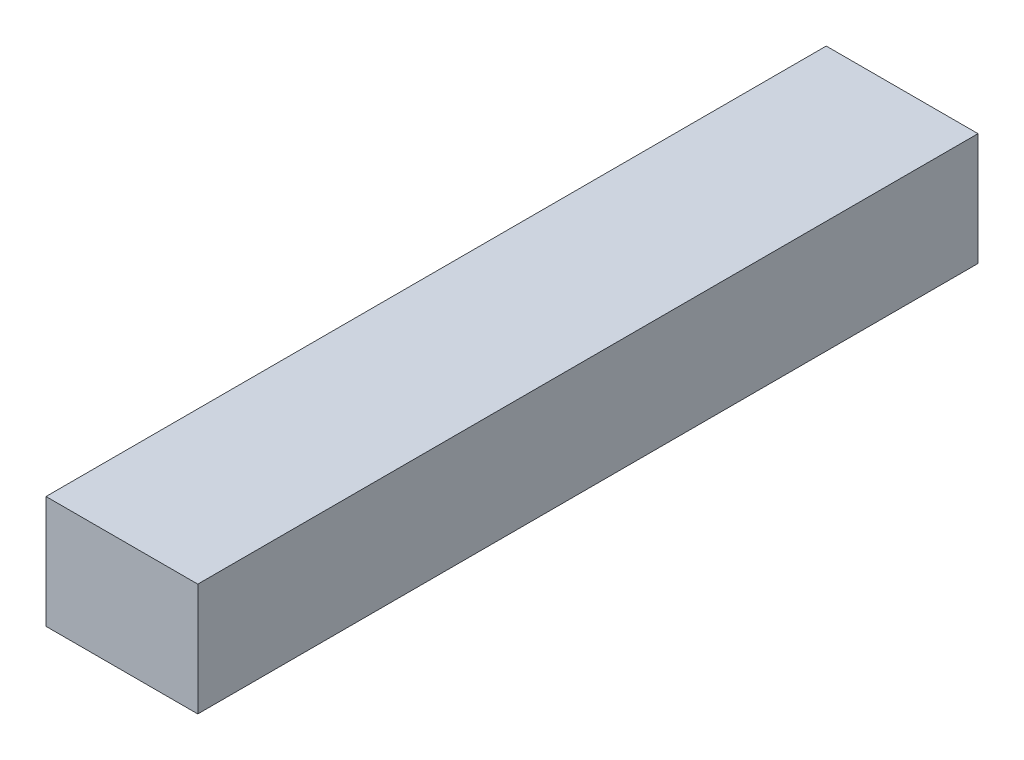
ISO-10303-21;
HEADER;
FILE_DESCRIPTION(('STEP AP214'),'2;1');
FILE_NAME('part.step','',(''),(''),'','','');
FILE_SCHEMA(('AUTOMOTIVE_DESIGN { 1 0 10303 214 1 1 1 1 }'));
ENDSEC;
DATA;
#1=APPLICATION_CONTEXT('core data for automotive mechanical design processes');
#2=APPLICATION_PROTOCOL_DEFINITION('international standard','automotive_design',2000,#1);
#3=PRODUCT_CONTEXT('',#1,'mechanical');
#4=PRODUCT('Part','Part','',(#3));
#5=PRODUCT_RELATED_PRODUCT_CATEGORY('part','',(#4));
#6=PRODUCT_DEFINITION_FORMATION('','',#4);
#7=PRODUCT_DEFINITION_CONTEXT('part definition',#1,'design');
#8=PRODUCT_DEFINITION('design','',#6,#7);
#9=PRODUCT_DEFINITION_SHAPE('','',#8);
#10=(LENGTH_UNIT() NAMED_UNIT(*) SI_UNIT(.MILLI.,.METRE.));
#11=(NAMED_UNIT(*) PLANE_ANGLE_UNIT() SI_UNIT($,.RADIAN.));
#12=(NAMED_UNIT(*) SI_UNIT($,.STERADIAN.) SOLID_ANGLE_UNIT());
#13=UNCERTAINTY_MEASURE_WITH_UNIT(LENGTH_MEASURE(1.E-05),#10,'distance_accuracy_value','');
#14=(GEOMETRIC_REPRESENTATION_CONTEXT(3) GLOBAL_UNCERTAINTY_ASSIGNED_CONTEXT((#13)) GLOBAL_UNIT_ASSIGNED_CONTEXT((#10,
#11,#12)) REPRESENTATION_CONTEXT('',''));
#15=CARTESIAN_POINT('',(0.,0.,0.));
#16=DIRECTION('',(0.,0.,1.));
#17=DIRECTION('',(1.,0.,0.));
#18=AXIS2_PLACEMENT_3D('',#15,#16,#17);
#19=CARTESIAN_POINT('',(3.9,-2.89,40.1));
#20=DIRECTION('',(-1.,0.,0.));
#21=DIRECTION('',(0.,0.,1.));
#22=AXIS2_PLACEMENT_3D('',#19,#20,#21);
#23=PLANE('',#22);
#24=DIRECTION('',(0.,1.,0.));
#25=VECTOR('',#24,1.);
#26=CARTESIAN_POINT('',(3.9,-2.89,0.));
#27=LINE('',#26,#25);
#28=CARTESIAN_POINT('',(3.9,-2.89,0.));
#29=VERTEX_POINT('',#28);
#30=CARTESIAN_POINT('',(3.9,2.89,0.));
#31=VERTEX_POINT('',#30);
#32=EDGE_CURVE('E96',#29,#31,#27,.T.);
#33=ORIENTED_EDGE('',*,*,#32,.T.);
#34=DIRECTION('',(0.,0.,-1.));
#35=VECTOR('',#34,1.);
#36=CARTESIAN_POINT('',(3.9,2.89,40.1));
#37=LINE('',#36,#35);
#38=CARTESIAN_POINT('',(3.9,2.89,40.1));
#39=VERTEX_POINT('',#38);
#40=EDGE_CURVE('E11',#39,#31,#37,.T.);
#41=ORIENTED_EDGE('',*,*,#40,.F.);
#42=DIRECTION('',(0.,1.,0.));
#43=VECTOR('',#42,1.);
#44=CARTESIAN_POINT('',(3.9,-2.89,40.1));
#45=LINE('',#44,#43);
#46=CARTESIAN_POINT('',(3.9,-2.89,40.1));
#47=VERTEX_POINT('',#46);
#48=EDGE_CURVE('E84',#47,#39,#45,.T.);
#49=ORIENTED_EDGE('',*,*,#48,.F.);
#50=DIRECTION('',(0.,0.,-1.));
#51=VECTOR('',#50,1.);
#52=CARTESIAN_POINT('',(3.9,-2.89,40.1));
#53=LINE('',#52,#51);
#54=EDGE_CURVE('E92',#47,#29,#53,.T.);
#55=ORIENTED_EDGE('',*,*,#54,.T.);
#56=EDGE_LOOP('',(#33,#41,#49,#55));
#57=FACE_BOUND('',#56,.T.);
#58=ADVANCED_FACE('F33',(#57),#23,.F.);
#59=CARTESIAN_POINT('',(-3.9,2.89,40.1));
#60=DIRECTION('',(0.,-1.,0.));
#61=DIRECTION('',(0.,0.,-1.));
#62=AXIS2_PLACEMENT_3D('',#59,#60,#61);
#63=PLANE('',#62);
#64=DIRECTION('',(-1.,0.,0.));
#65=VECTOR('',#64,1.);
#66=CARTESIAN_POINT('',(-3.9,2.89,0.));
#67=LINE('',#66,#65);
#68=CARTESIAN_POINT('',(-3.9,2.89,0.));
#69=VERTEX_POINT('',#68);
#70=EDGE_CURVE('E88',#31,#69,#67,.T.);
#71=ORIENTED_EDGE('',*,*,#70,.T.);
#72=DIRECTION('',(0.,0.,-1.));
#73=VECTOR('',#72,1.);
#74=CARTESIAN_POINT('',(-3.9,2.89,40.1));
#75=LINE('',#74,#73);
#76=CARTESIAN_POINT('',(-3.9,2.89,40.1));
#77=VERTEX_POINT('',#76);
#78=EDGE_CURVE('E41',#77,#69,#75,.T.);
#79=ORIENTED_EDGE('',*,*,#78,.F.);
#80=DIRECTION('',(-1.,0.,0.));
#81=VECTOR('',#80,1.);
#82=CARTESIAN_POINT('',(-3.9,2.89,40.1));
#83=LINE('',#82,#81);
#84=EDGE_CURVE('E79',#39,#77,#83,.T.);
#85=ORIENTED_EDGE('',*,*,#84,.F.);
#86=ORIENTED_EDGE('',*,*,#40,.T.);
#87=EDGE_LOOP('',(#71,#79,#85,#86));
#88=FACE_BOUND('',#87,.T.);
#89=ADVANCED_FACE('F87',(#88),#63,.F.);
#90=CARTESIAN_POINT('',(-3.9,-2.89,40.1));
#91=DIRECTION('',(1.,0.,0.));
#92=DIRECTION('',(0.,0.,-1.));
#93=AXIS2_PLACEMENT_3D('',#90,#91,#92);
#94=PLANE('',#93);
#95=DIRECTION('',(0.,-1.,0.));
#96=VECTOR('',#95,1.);
#97=CARTESIAN_POINT('',(-3.9,-2.89,0.));
#98=LINE('',#97,#96);
#99=CARTESIAN_POINT('',(-3.9,-2.89,0.));
#100=VERTEX_POINT('',#99);
#101=EDGE_CURVE('E66',#69,#100,#98,.T.);
#102=ORIENTED_EDGE('',*,*,#101,.T.);
#103=DIRECTION('',(0.,0.,-1.));
#104=VECTOR('',#103,1.);
#105=CARTESIAN_POINT('',(-3.9,-2.89,40.1));
#106=LINE('',#105,#104);
#107=CARTESIAN_POINT('',(-3.9,-2.89,40.1));
#108=VERTEX_POINT('',#107);
#109=EDGE_CURVE('E89',#108,#100,#106,.T.);
#110=ORIENTED_EDGE('',*,*,#109,.F.);
#111=DIRECTION('',(0.,-1.,0.));
#112=VECTOR('',#111,1.);
#113=CARTESIAN_POINT('',(-3.9,-2.89,40.1));
#114=LINE('',#113,#112);
#115=EDGE_CURVE('E82',#77,#108,#114,.T.);
#116=ORIENTED_EDGE('',*,*,#115,.F.);
#117=ORIENTED_EDGE('',*,*,#78,.T.);
#118=EDGE_LOOP('',(#102,#110,#116,#117));
#119=FACE_BOUND('',#118,.T.);
#120=ADVANCED_FACE('F90',(#119),#94,.F.);
#121=CARTESIAN_POINT('',(-3.9,-2.89,40.1));
#122=DIRECTION('',(0.,1.,0.));
#123=DIRECTION('',(0.,0.,1.));
#124=AXIS2_PLACEMENT_3D('',#121,#122,#123);
#125=PLANE('',#124);
#126=DIRECTION('',(1.,0.,0.));
#127=VECTOR('',#126,1.);
#128=CARTESIAN_POINT('',(-3.9,-2.89,0.));
#129=LINE('',#128,#127);
#130=EDGE_CURVE('E72',#100,#29,#129,.T.);
#131=ORIENTED_EDGE('',*,*,#130,.T.);
#132=ORIENTED_EDGE('',*,*,#54,.F.);
#133=DIRECTION('',(1.,0.,0.));
#134=VECTOR('',#133,1.);
#135=CARTESIAN_POINT('',(-3.9,-2.89,40.1));
#136=LINE('',#135,#134);
#137=EDGE_CURVE('E49',#108,#47,#136,.T.);
#138=ORIENTED_EDGE('',*,*,#137,.F.);
#139=ORIENTED_EDGE('',*,*,#109,.T.);
#140=EDGE_LOOP('',(#131,#132,#138,#139));
#141=FACE_BOUND('',#140,.T.);
#142=ADVANCED_FACE('F103',(#141),#125,.F.);
#143=CARTESIAN_POINT('',(0.,0.,40.1));
#144=DIRECTION('',(0.,0.,-1.));
#145=DIRECTION('',(-1.,0.,0.));
#146=AXIS2_PLACEMENT_3D('',#143,#144,#145);
#147=PLANE('',#146);
#148=ORIENTED_EDGE('',*,*,#48,.T.);
#149=ORIENTED_EDGE('',*,*,#84,.T.);
#150=ORIENTED_EDGE('',*,*,#115,.T.);
#151=ORIENTED_EDGE('',*,*,#137,.T.);
#152=EDGE_LOOP('',(#148,#149,#150,#151));
#153=FACE_BOUND('',#152,.T.);
#154=ADVANCED_FACE('F80',(#153),#147,.F.);
#155=CARTESIAN_POINT('',(0.,0.,0.));
#156=DIRECTION('',(0.,0.,-1.));
#157=DIRECTION('',(-1.,0.,0.));
#158=AXIS2_PLACEMENT_3D('',#155,#156,#157);
#159=PLANE('',#158);
#160=ORIENTED_EDGE('',*,*,#32,.F.);
#161=ORIENTED_EDGE('',*,*,#130,.F.);
#162=ORIENTED_EDGE('',*,*,#101,.F.);
#163=ORIENTED_EDGE('',*,*,#70,.F.);
#164=EDGE_LOOP('',(#160,#161,#162,#163));
#165=FACE_BOUND('',#164,.T.);
#166=ADVANCED_FACE('F106',(#165),#159,.T.);
#167=CLOSED_SHELL('',(#58,#89,#120,#142,#154,#166));
#168=MANIFOLD_SOLID_BREP('B2',#167);
#169=ADVANCED_BREP_SHAPE_REPRESENTATION('',(#18,#168),#14);
#170=SHAPE_DEFINITION_REPRESENTATION(#9,#169);
ENDSEC;
END-ISO-10303-21;
